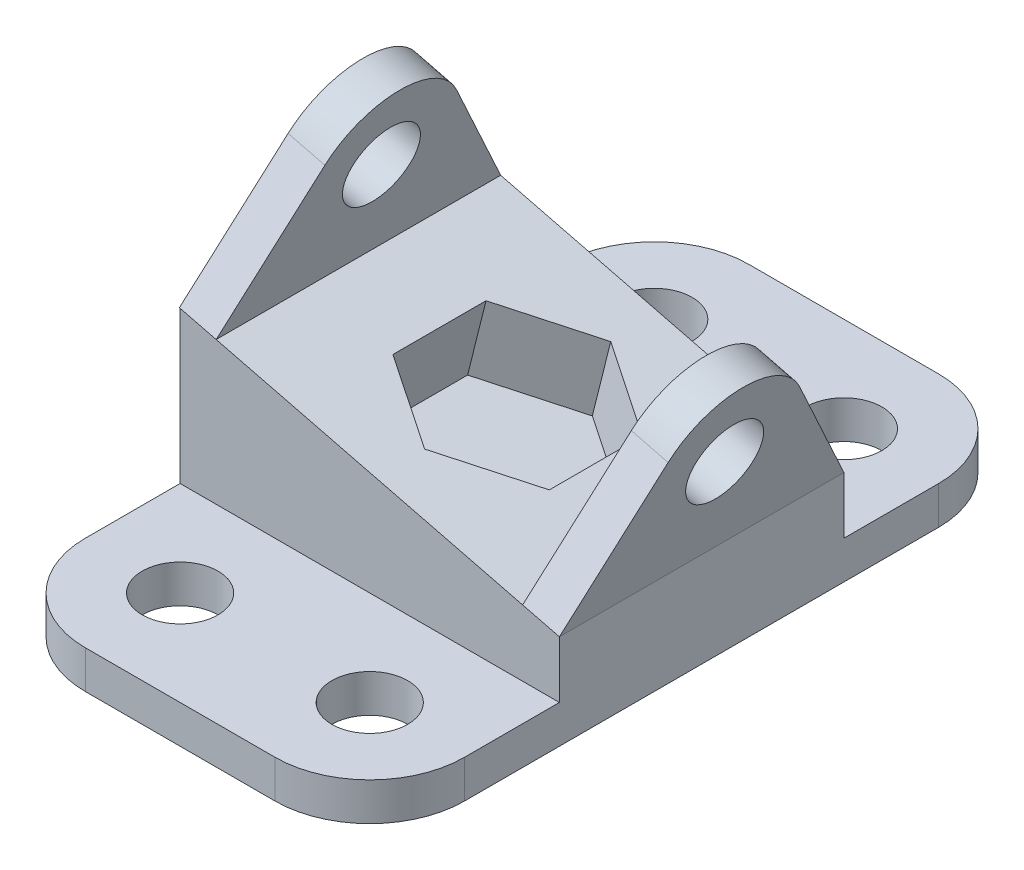
ISO-10303-21;
HEADER;
FILE_DESCRIPTION(('STEP AP214'),'2;1');
FILE_NAME('part.step','',(''),(''),'','','');
FILE_SCHEMA(('AUTOMOTIVE_DESIGN { 1 0 10303 214 1 1 1 1 }'));
ENDSEC;
DATA;
#1=APPLICATION_CONTEXT('core data for automotive mechanical design processes');
#2=APPLICATION_PROTOCOL_DEFINITION('international standard','automotive_design',2000,#1);
#3=PRODUCT_CONTEXT('',#1,'mechanical');
#4=PRODUCT('Part','Part','',(#3));
#5=PRODUCT_RELATED_PRODUCT_CATEGORY('part','',(#4));
#6=PRODUCT_DEFINITION_FORMATION('','',#4);
#7=PRODUCT_DEFINITION_CONTEXT('part definition',#1,'design');
#8=PRODUCT_DEFINITION('design','',#6,#7);
#9=PRODUCT_DEFINITION_SHAPE('','',#8);
#10=(LENGTH_UNIT() NAMED_UNIT(*) SI_UNIT(.MILLI.,.METRE.));
#11=(NAMED_UNIT(*) PLANE_ANGLE_UNIT() SI_UNIT($,.RADIAN.));
#12=(NAMED_UNIT(*) SI_UNIT($,.STERADIAN.) SOLID_ANGLE_UNIT());
#13=UNCERTAINTY_MEASURE_WITH_UNIT(LENGTH_MEASURE(1.E-05),#10,'distance_accuracy_value','');
#14=(GEOMETRIC_REPRESENTATION_CONTEXT(3) GLOBAL_UNCERTAINTY_ASSIGNED_CONTEXT((#13)) GLOBAL_UNIT_ASSIGNED_CONTEXT((#10,
#11,#12)) REPRESENTATION_CONTEXT('',''));
#15=CARTESIAN_POINT('',(0.,0.,0.));
#16=DIRECTION('',(0.,0.,1.));
#17=DIRECTION('',(1.,0.,0.));
#18=AXIS2_PLACEMENT_3D('',#15,#16,#17);
#19=CARTESIAN_POINT('',(0.,40.,60.));
#20=DIRECTION('',(1.,0.,0.));
#21=DIRECTION('',(0.,1.,0.));
#22=AXIS2_PLACEMENT_3D('',#19,#20,#21);
#23=PLANE('',#22);
#24=DIRECTION('',(0.,0.,-1.));
#25=VECTOR('',#24,1.);
#26=CARTESIAN_POINT('',(0.,0.,60.));
#27=LINE('',#26,#25);
#28=CARTESIAN_POINT('',(0.,0.,80.));
#29=VERTEX_POINT('',#28);
#30=CARTESIAN_POINT('',(0.,0.,-20.));
#31=VERTEX_POINT('',#30);
#32=EDGE_CURVE('E483',#29,#31,#27,.T.);
#33=ORIENTED_EDGE('',*,*,#32,.F.);
#34=DIRECTION('',(0.,-1.,0.));
#35=VECTOR('',#34,1.);
#36=CARTESIAN_POINT('',(0.,40.,80.));
#37=LINE('',#36,#35);
#38=CARTESIAN_POINT('',(0.,8.,80.));
#39=VERTEX_POINT('',#38);
#40=EDGE_CURVE('E511',#29,#39,#37,.F.);
#41=ORIENTED_EDGE('',*,*,#40,.T.);
#42=DIRECTION('',(0.,0.,-1.));
#43=VECTOR('',#42,1.);
#44=CARTESIAN_POINT('',(0.,8.,100.));
#45=LINE('',#44,#43);
#46=CARTESIAN_POINT('',(0.,8.,60.));
#47=VERTEX_POINT('',#46);
#48=EDGE_CURVE('E435',#39,#47,#45,.T.);
#49=ORIENTED_EDGE('',*,*,#48,.T.);
#50=DIRECTION('',(0.,-1.,0.));
#51=VECTOR('',#50,1.);
#52=CARTESIAN_POINT('',(0.,40.,60.));
#53=LINE('',#52,#51);
#54=CARTESIAN_POINT('',(0.,40.,60.));
#55=VERTEX_POINT('',#54);
#56=EDGE_CURVE('E445',#55,#47,#53,.T.);
#57=ORIENTED_EDGE('',*,*,#56,.F.);
#58=DIRECTION('',(0.,0.,-1.));
#59=VECTOR('',#58,1.);
#60=CARTESIAN_POINT('',(0.,40.,60.));
#61=LINE('',#60,#59);
#62=CARTESIAN_POINT('',(0.,40.,0.));
#63=VERTEX_POINT('',#62);
#64=EDGE_CURVE('E459',#55,#63,#61,.T.);
#65=ORIENTED_EDGE('',*,*,#64,.T.);
#66=DIRECTION('',(0.,-1.,0.));
#67=VECTOR('',#66,1.);
#68=CARTESIAN_POINT('',(0.,40.,0.));
#69=LINE('',#68,#67);
#70=CARTESIAN_POINT('',(0.,8.,0.));
#71=VERTEX_POINT('',#70);
#72=EDGE_CURVE('E444',#63,#71,#69,.T.);
#73=ORIENTED_EDGE('',*,*,#72,.T.);
#74=DIRECTION('',(0.,0.,1.));
#75=VECTOR('',#74,1.);
#76=CARTESIAN_POINT('',(0.,8.,-40.));
#77=LINE('',#76,#75);
#78=CARTESIAN_POINT('',(0.,8.,-20.));
#79=VERTEX_POINT('',#78);
#80=EDGE_CURVE('E423',#79,#71,#77,.T.);
#81=ORIENTED_EDGE('',*,*,#80,.F.);
#82=DIRECTION('',(0.,-1.,0.));
#83=VECTOR('',#82,1.);
#84=CARTESIAN_POINT('',(0.,40.,-20.));
#85=LINE('',#84,#83);
#86=EDGE_CURVE('E507',#79,#31,#85,.T.);
#87=ORIENTED_EDGE('',*,*,#86,.T.);
#88=EDGE_LOOP('',(#33,#41,#49,#57,#65,#73,#81,#87));
#89=FACE_BOUND('',#88,.T.);
#90=ADVANCED_FACE('F41',(#89),#23,.F.);
#91=CARTESIAN_POINT('',(0.,0.,60.));
#92=DIRECTION('',(0.,1.,0.));
#93=DIRECTION('',(0.,0.,1.));
#94=AXIS2_PLACEMENT_3D('',#91,#92,#93);
#95=PLANE('',#94);
#96=CARTESIAN_POINT('',(20.000000000001,0.,80.));
#97=DIRECTION('',(0.,1.,0.));
#98=DIRECTION('',(0.,0.,1.));
#99=AXIS2_PLACEMENT_3D('',#96,#97,#98);
#100=CIRCLE('',#99,8.);
#101=CARTESIAN_POINT('',(20.000000000001,0.,88.));
#102=VERTEX_POINT('',#101);
#103=EDGE_CURVE('E299',#102,#102,#100,.T.);
#104=ORIENTED_EDGE('',*,*,#103,.T.);
#105=EDGE_LOOP('',(#104));
#106=FACE_BOUND('',#105,.T.);
#107=CARTESIAN_POINT('',(60.000000000001,0.,80.));
#108=DIRECTION('',(0.,1.,0.));
#109=DIRECTION('',(0.,0.,1.));
#110=AXIS2_PLACEMENT_3D('',#107,#108,#109);
#111=CIRCLE('',#110,8.);
#112=CARTESIAN_POINT('',(60.000000000001,0.,88.));
#113=VERTEX_POINT('',#112);
#114=EDGE_CURVE('E291',#113,#113,#111,.T.);
#115=ORIENTED_EDGE('',*,*,#114,.T.);
#116=EDGE_LOOP('',(#115));
#117=FACE_BOUND('',#116,.T.);
#118=CARTESIAN_POINT('',(60.,0.,-20.));
#119=DIRECTION('',(0.,1.,0.));
#120=DIRECTION('',(0.,0.,1.));
#121=AXIS2_PLACEMENT_3D('',#118,#119,#120);
#122=CIRCLE('',#121,8.00000000000001);
#123=CARTESIAN_POINT('',(60.,0.,-12.));
#124=VERTEX_POINT('',#123);
#125=EDGE_CURVE('E282',#124,#124,#122,.T.);
#126=ORIENTED_EDGE('',*,*,#125,.T.);
#127=EDGE_LOOP('',(#126));
#128=FACE_BOUND('',#127,.T.);
#129=CARTESIAN_POINT('',(20.,0.,-20.));
#130=DIRECTION('',(0.,1.,0.));
#131=DIRECTION('',(0.,0.,1.));
#132=AXIS2_PLACEMENT_3D('',#129,#130,#131);
#133=CIRCLE('',#132,8.);
#134=CARTESIAN_POINT('',(20.,0.,-12.));
#135=VERTEX_POINT('',#134);
#136=EDGE_CURVE('E306',#135,#135,#133,.T.);
#137=ORIENTED_EDGE('',*,*,#136,.T.);
#138=EDGE_LOOP('',(#137));
#139=FACE_BOUND('',#138,.T.);
#140=DIRECTION('',(1.,0.,0.));
#141=VECTOR('',#140,1.);
#142=CARTESIAN_POINT('',(0.,0.,100.));
#143=LINE('',#142,#141);
#144=CARTESIAN_POINT('',(20.,0.,100.));
#145=VERTEX_POINT('',#144);
#146=CARTESIAN_POINT('',(60.,0.,100.));
#147=VERTEX_POINT('',#146);
#148=EDGE_CURVE('E427',#145,#147,#143,.T.);
#149=ORIENTED_EDGE('',*,*,#148,.F.);
#150=CARTESIAN_POINT('',(20.,0.,80.));
#151=DIRECTION('',(0.,1.,0.));
#152=DIRECTION('',(0.,0.,1.));
#153=AXIS2_PLACEMENT_3D('',#150,#151,#152);
#154=CIRCLE('',#153,20.);
#155=EDGE_CURVE('E504',#145,#29,#154,.F.);
#156=ORIENTED_EDGE('',*,*,#155,.T.);
#157=ORIENTED_EDGE('',*,*,#32,.T.);
#158=CARTESIAN_POINT('',(20.,0.,-20.));
#159=DIRECTION('',(0.,1.,0.));
#160=DIRECTION('',(0.,0.,1.));
#161=AXIS2_PLACEMENT_3D('',#158,#159,#160);
#162=CIRCLE('',#161,20.);
#163=CARTESIAN_POINT('',(20.,0.,-40.));
#164=VERTEX_POINT('',#163);
#165=EDGE_CURVE('E501',#31,#164,#162,.F.);
#166=ORIENTED_EDGE('',*,*,#165,.T.);
#167=DIRECTION('',(1.,0.,0.));
#168=VECTOR('',#167,1.);
#169=CARTESIAN_POINT('',(0.,0.,-40.));
#170=LINE('',#169,#168);
#171=CARTESIAN_POINT('',(60.,0.,-40.));
#172=VERTEX_POINT('',#171);
#173=EDGE_CURVE('E413',#164,#172,#170,.T.);
#174=ORIENTED_EDGE('',*,*,#173,.T.);
#175=CARTESIAN_POINT('',(60.,0.,-20.));
#176=DIRECTION('',(0.,1.,0.));
#177=DIRECTION('',(0.,0.,1.));
#178=AXIS2_PLACEMENT_3D('',#175,#176,#177);
#179=CIRCLE('',#178,20.);
#180=CARTESIAN_POINT('',(80.,0.,-20.));
#181=VERTEX_POINT('',#180);
#182=EDGE_CURVE('E498',#172,#181,#179,.F.);
#183=ORIENTED_EDGE('',*,*,#182,.T.);
#184=DIRECTION('',(0.,0.,-1.));
#185=VECTOR('',#184,1.);
#186=CARTESIAN_POINT('',(80.,0.,60.));
#187=LINE('',#186,#185);
#188=CARTESIAN_POINT('',(80.,0.,80.));
#189=VERTEX_POINT('',#188);
#190=EDGE_CURVE('E479',#189,#181,#187,.T.);
#191=ORIENTED_EDGE('',*,*,#190,.F.);
#192=CARTESIAN_POINT('',(60.,0.,80.));
#193=DIRECTION('',(0.,1.,0.));
#194=DIRECTION('',(0.,0.,1.));
#195=AXIS2_PLACEMENT_3D('',#192,#193,#194);
#196=CIRCLE('',#195,20.);
#197=EDGE_CURVE('E495',#189,#147,#196,.F.);
#198=ORIENTED_EDGE('',*,*,#197,.T.);
#199=EDGE_LOOP('',(#149,#156,#157,#166,#174,#183,#191,#198));
#200=FACE_BOUND('',#199,.T.);
#201=ADVANCED_FACE('F541',(#106,#117,#128,#139,#200),#95,.F.);
#202=CARTESIAN_POINT('',(80.,0.,60.));
#203=DIRECTION('',(-1.,0.,0.));
#204=DIRECTION('',(0.,0.,1.));
#205=AXIS2_PLACEMENT_3D('',#202,#203,#204);
#206=PLANE('',#205);
#207=ORIENTED_EDGE('',*,*,#190,.T.);
#208=DIRECTION('',(0.,1.,0.));
#209=VECTOR('',#208,1.);
#210=CARTESIAN_POINT('',(80.,0.,-20.));
#211=LINE('',#210,#209);
#212=CARTESIAN_POINT('',(80.,8.,-20.));
#213=VERTEX_POINT('',#212);
#214=EDGE_CURVE('E11',#181,#213,#211,.T.);
#215=ORIENTED_EDGE('',*,*,#214,.T.);
#216=DIRECTION('',(0.,0.,1.));
#217=VECTOR('',#216,1.);
#218=CARTESIAN_POINT('',(80.,8.,-40.));
#219=LINE('',#218,#217);
#220=CARTESIAN_POINT('',(80.,8.,0.));
#221=VERTEX_POINT('',#220);
#222=EDGE_CURVE('E417',#213,#221,#219,.T.);
#223=ORIENTED_EDGE('',*,*,#222,.T.);
#224=DIRECTION('',(0.,1.,0.));
#225=VECTOR('',#224,1.);
#226=CARTESIAN_POINT('',(80.,0.,0.));
#227=LINE('',#226,#225);
#228=CARTESIAN_POINT('',(80.,20.,0.));
#229=VERTEX_POINT('',#228);
#230=EDGE_CURVE('E463',#221,#229,#227,.T.);
#231=ORIENTED_EDGE('',*,*,#230,.T.);
#232=DIRECTION('',(0.,0.,-1.));
#233=VECTOR('',#232,1.);
#234=CARTESIAN_POINT('',(80.,20.,60.));
#235=LINE('',#234,#233);
#236=CARTESIAN_POINT('',(80.,20.,60.));
#237=VERTEX_POINT('',#236);
#238=EDGE_CURVE('E475',#237,#229,#235,.T.);
#239=ORIENTED_EDGE('',*,*,#238,.F.);
#240=DIRECTION('',(0.,1.,0.));
#241=VECTOR('',#240,1.);
#242=CARTESIAN_POINT('',(80.,0.,60.));
#243=LINE('',#242,#241);
#244=CARTESIAN_POINT('',(80.,8.,60.));
#245=VERTEX_POINT('',#244);
#246=EDGE_CURVE('E449',#245,#237,#243,.T.);
#247=ORIENTED_EDGE('',*,*,#246,.F.);
#248=DIRECTION('',(0.,0.,-1.));
#249=VECTOR('',#248,1.);
#250=CARTESIAN_POINT('',(80.,8.,100.));
#251=LINE('',#250,#249);
#252=CARTESIAN_POINT('',(80.,8.,80.));
#253=VERTEX_POINT('',#252);
#254=EDGE_CURVE('E441',#253,#245,#251,.T.);
#255=ORIENTED_EDGE('',*,*,#254,.F.);
#256=DIRECTION('',(0.,1.,0.));
#257=VECTOR('',#256,1.);
#258=CARTESIAN_POINT('',(80.,0.,80.));
#259=LINE('',#258,#257);
#260=EDGE_CURVE('E50',#253,#189,#259,.F.);
#261=ORIENTED_EDGE('',*,*,#260,.T.);
#262=EDGE_LOOP('',(#207,#215,#223,#231,#239,#247,#255,#261));
#263=FACE_BOUND('',#262,.T.);
#264=ADVANCED_FACE('F535',(#263),#206,.F.);
#265=CARTESIAN_POINT('',(80.,20.,60.));
#266=DIRECTION('',(-0.242535625036333,-0.970142500145332,0.));
#267=DIRECTION('',(0.970142500145332,-0.242535625036333,0.));
#268=AXIS2_PLACEMENT_3D('',#265,#266,#267);
#269=PLANE('',#268);
#270=DIRECTION('',(-0.840168050416806,0.210042012604201,0.5));
#271=VECTOR('',#270,1.);
#272=CARTESIAN_POINT('',(41.1942999941868,29.7014250014533,10.3700908475527));
#273=LINE('',#272,#271);
#274=CARTESIAN_POINT('',(41.1942999941868,29.7014250014533,10.3700908475527));
#275=VERTEX_POINT('',#274);
#276=CARTESIAN_POINT('',(24.7018774917161,33.824530627071,20.1850454237764));
#277=VERTEX_POINT('',#276);
#278=EDGE_CURVE('E253',#275,#277,#273,.T.);
#279=ORIENTED_EDGE('',*,*,#278,.F.);
#280=DIRECTION('',(-0.840168050416806,0.210042012604201,-0.5));
#281=VECTOR('',#280,1.);
#282=CARTESIAN_POINT('',(57.6867224966574,25.5783193758357,20.1850454237764));
#283=LINE('',#282,#281);
#284=CARTESIAN_POINT('',(57.6867224966574,25.5783193758357,20.1850454237764));
#285=VERTEX_POINT('',#284);
#286=EDGE_CURVE('E57',#285,#275,#283,.T.);
#287=ORIENTED_EDGE('',*,*,#286,.F.);
#288=DIRECTION('',(0.,0.,-1.));
#289=VECTOR('',#288,1.);
#290=CARTESIAN_POINT('',(57.6867224966574,25.5783193758357,39.8149545762237));
#291=LINE('',#290,#289);
#292=CARTESIAN_POINT('',(57.6867224966574,25.5783193758357,39.8149545762237));
#293=VERTEX_POINT('',#292);
#294=EDGE_CURVE('E233',#293,#285,#291,.T.);
#295=ORIENTED_EDGE('',*,*,#294,.F.);
#296=DIRECTION('',(0.840168050416806,-0.210042012604201,-0.5));
#297=VECTOR('',#296,1.);
#298=CARTESIAN_POINT('',(41.1942999941868,29.7014250014533,49.6299091524473));
#299=LINE('',#298,#297);
#300=CARTESIAN_POINT('',(41.1942999941868,29.7014250014533,49.6299091524473));
#301=VERTEX_POINT('',#300);
#302=EDGE_CURVE('E237',#301,#293,#299,.T.);
#303=ORIENTED_EDGE('',*,*,#302,.F.);
#304=DIRECTION('',(0.840168050416806,-0.210042012604202,0.5));
#305=VECTOR('',#304,1.);
#306=CARTESIAN_POINT('',(24.7018774917161,33.824530627071,39.8149545762236));
#307=LINE('',#306,#305);
#308=CARTESIAN_POINT('',(24.7018774917161,33.824530627071,39.8149545762236));
#309=VERTEX_POINT('',#308);
#310=EDGE_CURVE('E260',#309,#301,#307,.T.);
#311=ORIENTED_EDGE('',*,*,#310,.F.);
#312=DIRECTION('',(0.,0.,1.));
#313=VECTOR('',#312,1.);
#314=CARTESIAN_POINT('',(24.7018774917161,33.824530627071,20.1850454237764));
#315=LINE('',#314,#313);
#316=EDGE_CURVE('E256',#277,#309,#315,.T.);
#317=ORIENTED_EDGE('',*,*,#316,.F.);
#318=EDGE_LOOP('',(#279,#287,#295,#303,#311,#317));
#319=FACE_BOUND('',#318,.T.);
#320=DIRECTION('',(-0.970142500145332,0.242535625036333,0.));
#321=VECTOR('',#320,1.);
#322=CARTESIAN_POINT('',(80.,20.,0.));
#323=LINE('',#322,#321);
#324=CARTESIAN_POINT('',(72.2388599988374,21.9402850002907,0.));
#325=VERTEX_POINT('',#324);
#326=CARTESIAN_POINT('',(7.60796663915537,38.0980083402112,0.));
#327=VERTEX_POINT('',#326);
#328=EDGE_CURVE('E471',#325,#327,#323,.T.);
#329=ORIENTED_EDGE('',*,*,#328,.T.);
#330=DIRECTION('',(0.,0.,-1.));
#331=VECTOR('',#330,1.);
#332=CARTESIAN_POINT('',(7.60796663915536,38.0980083402111,0.));
#333=LINE('',#332,#331);
#334=CARTESIAN_POINT('',(7.60796663915537,38.0980083402112,60.));
#335=VERTEX_POINT('',#334);
#336=EDGE_CURVE('E346',#335,#327,#333,.T.);
#337=ORIENTED_EDGE('',*,*,#336,.F.);
#338=DIRECTION('',(-0.970142500145332,0.242535625036333,0.));
#339=VECTOR('',#338,1.);
#340=CARTESIAN_POINT('',(80.,20.,60.));
#341=LINE('',#340,#339);
#342=CARTESIAN_POINT('',(72.2388599988374,21.9402850002907,60.));
#343=VERTEX_POINT('',#342);
#344=EDGE_CURVE('E454',#343,#335,#341,.T.);
#345=ORIENTED_EDGE('',*,*,#344,.F.);
#346=DIRECTION('',(0.,0.,-1.));
#347=VECTOR('',#346,1.);
#348=CARTESIAN_POINT('',(72.2388599988374,21.9402850002907,0.));
#349=LINE('',#348,#347);
#350=EDGE_CURVE('E380',#343,#325,#349,.T.);
#351=ORIENTED_EDGE('',*,*,#350,.T.);
#352=EDGE_LOOP('',(#329,#337,#345,#351));
#353=FACE_BOUND('',#352,.T.);
#354=ADVANCED_FACE('F614',(#319,#353),#269,.F.);
#355=CARTESIAN_POINT('',(0.,0.,60.));
#356=DIRECTION('',(0.,0.,1.));
#357=DIRECTION('',(1.,0.,0.));
#358=AXIS2_PLACEMENT_3D('',#355,#356,#357);
#359=PLANE('',#358);
#360=DIRECTION('',(-1.,0.,0.));
#361=VECTOR('',#360,1.);
#362=CARTESIAN_POINT('',(0.,8.,60.));
#363=LINE('',#362,#361);
#364=EDGE_CURVE('E426',#245,#47,#363,.T.);
#365=ORIENTED_EDGE('',*,*,#364,.F.);
#366=ORIENTED_EDGE('',*,*,#246,.T.);
#367=EDGE_CURVE('E455',#237,#343,#341,.T.);
#368=ORIENTED_EDGE('',*,*,#367,.T.);
#369=ORIENTED_EDGE('',*,*,#344,.T.);
#370=DIRECTION('',(0.970142500145332,-0.242535625036333,0.));
#371=VECTOR('',#370,1.);
#372=CARTESIAN_POINT('',(-0.153173362007295,40.0382933405018,60.));
#373=LINE('',#372,#371);
#374=EDGE_CURVE('E362',#55,#335,#373,.T.);
#375=ORIENTED_EDGE('',*,*,#374,.F.);
#376=ORIENTED_EDGE('',*,*,#56,.T.);
#377=EDGE_LOOP('',(#365,#366,#368,#369,#375,#376));
#378=FACE_BOUND('',#377,.T.);
#379=ADVANCED_FACE('F587',(#378),#359,.T.);
#380=CARTESIAN_POINT('',(0.,0.,0.));
#381=DIRECTION('',(0.,0.,1.));
#382=DIRECTION('',(1.,0.,0.));
#383=AXIS2_PLACEMENT_3D('',#380,#381,#382);
#384=PLANE('',#383);
#385=ORIENTED_EDGE('',*,*,#230,.F.);
#386=DIRECTION('',(-1.,0.,0.));
#387=VECTOR('',#386,1.);
#388=CARTESIAN_POINT('',(0.,8.,0.));
#389=LINE('',#388,#387);
#390=EDGE_CURVE('E406',#221,#71,#389,.T.);
#391=ORIENTED_EDGE('',*,*,#390,.T.);
#392=ORIENTED_EDGE('',*,*,#72,.F.);
#393=EDGE_CURVE('E467',#327,#63,#323,.T.);
#394=ORIENTED_EDGE('',*,*,#393,.F.);
#395=ORIENTED_EDGE('',*,*,#328,.F.);
#396=EDGE_CURVE('E450',#229,#325,#323,.T.);
#397=ORIENTED_EDGE('',*,*,#396,.F.);
#398=EDGE_LOOP('',(#385,#391,#392,#394,#395,#397));
#399=FACE_BOUND('',#398,.T.);
#400=ADVANCED_FACE('F575',(#399),#384,.F.);
#401=CARTESIAN_POINT('',(0.,8.,100.));
#402=DIRECTION('',(0.,-1.,0.));
#403=DIRECTION('',(0.,0.,-1.));
#404=AXIS2_PLACEMENT_3D('',#401,#402,#403);
#405=PLANE('',#404);
#406=CARTESIAN_POINT('',(20.000000000001,8.,80.));
#407=DIRECTION('',(0.,1.,0.));
#408=DIRECTION('',(0.,0.,1.));
#409=AXIS2_PLACEMENT_3D('',#406,#407,#408);
#410=CIRCLE('',#409,8.);
#411=CARTESIAN_POINT('',(20.000000000001,8.,88.));
#412=VERTEX_POINT('',#411);
#413=EDGE_CURVE('E270',#412,#412,#410,.T.);
#414=ORIENTED_EDGE('',*,*,#413,.F.);
#415=EDGE_LOOP('',(#414));
#416=FACE_BOUND('',#415,.T.);
#417=CARTESIAN_POINT('',(60.000000000001,8.,80.));
#418=DIRECTION('',(0.,1.,0.));
#419=DIRECTION('',(0.,0.,1.));
#420=AXIS2_PLACEMENT_3D('',#417,#418,#419);
#421=CIRCLE('',#420,8.);
#422=CARTESIAN_POINT('',(60.000000000001,8.,88.));
#423=VERTEX_POINT('',#422);
#424=EDGE_CURVE('E295',#423,#423,#421,.T.);
#425=ORIENTED_EDGE('',*,*,#424,.F.);
#426=EDGE_LOOP('',(#425));
#427=FACE_BOUND('',#426,.T.);
#428=ORIENTED_EDGE('',*,*,#48,.F.);
#429=CARTESIAN_POINT('',(20.,8.,80.));
#430=DIRECTION('',(0.,-1.,0.));
#431=DIRECTION('',(0.,0.,-1.));
#432=AXIS2_PLACEMENT_3D('',#429,#430,#431);
#433=CIRCLE('',#432,20.);
#434=CARTESIAN_POINT('',(20.,8.,100.));
#435=VERTEX_POINT('',#434);
#436=EDGE_CURVE('E517',#39,#435,#433,.F.);
#437=ORIENTED_EDGE('',*,*,#436,.T.);
#438=DIRECTION('',(-1.,0.,0.));
#439=VECTOR('',#438,1.);
#440=CARTESIAN_POINT('',(0.,8.,100.));
#441=LINE('',#440,#439);
#442=CARTESIAN_POINT('',(60.,8.,100.));
#443=VERTEX_POINT('',#442);
#444=EDGE_CURVE('E431',#443,#435,#441,.T.);
#445=ORIENTED_EDGE('',*,*,#444,.F.);
#446=CARTESIAN_POINT('',(60.,8.,80.));
#447=DIRECTION('',(0.,-1.,0.));
#448=DIRECTION('',(0.,0.,-1.));
#449=AXIS2_PLACEMENT_3D('',#446,#447,#448);
#450=CIRCLE('',#449,20.);
#451=EDGE_CURVE('E514',#443,#253,#450,.F.);
#452=ORIENTED_EDGE('',*,*,#451,.T.);
#453=ORIENTED_EDGE('',*,*,#254,.T.);
#454=ORIENTED_EDGE('',*,*,#364,.T.);
#455=EDGE_LOOP('',(#428,#437,#445,#452,#453,#454));
#456=FACE_BOUND('',#455,.T.);
#457=ADVANCED_FACE('F550',(#416,#427,#456),#405,.F.);
#458=CARTESIAN_POINT('',(0.,0.,100.));
#459=DIRECTION('',(0.,0.,-1.));
#460=DIRECTION('',(-1.,0.,0.));
#461=AXIS2_PLACEMENT_3D('',#458,#459,#460);
#462=PLANE('',#461);
#463=ORIENTED_EDGE('',*,*,#444,.T.);
#464=DIRECTION('',(0.,-1.,0.));
#465=VECTOR('',#464,1.);
#466=CARTESIAN_POINT('',(20.,0.,100.));
#467=LINE('',#466,#465);
#468=EDGE_CURVE('E491',#435,#145,#467,.T.);
#469=ORIENTED_EDGE('',*,*,#468,.T.);
#470=ORIENTED_EDGE('',*,*,#148,.T.);
#471=DIRECTION('',(0.,1.,0.));
#472=VECTOR('',#471,1.);
#473=CARTESIAN_POINT('',(60.,0.,100.));
#474=LINE('',#473,#472);
#475=EDGE_CURVE('E487',#147,#443,#474,.T.);
#476=ORIENTED_EDGE('',*,*,#475,.T.);
#477=EDGE_LOOP('',(#463,#469,#470,#476));
#478=FACE_BOUND('',#477,.T.);
#479=ADVANCED_FACE('F546',(#478),#462,.F.);
#480=CARTESIAN_POINT('',(0.,8.,-40.));
#481=DIRECTION('',(0.,1.,0.));
#482=DIRECTION('',(0.,0.,1.));
#483=AXIS2_PLACEMENT_3D('',#480,#481,#482);
#484=PLANE('',#483);
#485=CARTESIAN_POINT('',(60.,8.,-20.));
#486=DIRECTION('',(0.,1.,0.));
#487=DIRECTION('',(0.,0.,1.));
#488=AXIS2_PLACEMENT_3D('',#485,#486,#487);
#489=CIRCLE('',#488,8.00000000000001);
#490=CARTESIAN_POINT('',(60.,8.,-12.));
#491=VERTEX_POINT('',#490);
#492=EDGE_CURVE('E287',#491,#491,#489,.T.);
#493=ORIENTED_EDGE('',*,*,#492,.F.);
#494=EDGE_LOOP('',(#493));
#495=FACE_BOUND('',#494,.T.);
#496=CARTESIAN_POINT('',(20.,8.,-20.));
#497=DIRECTION('',(0.,1.,0.));
#498=DIRECTION('',(0.,0.,1.));
#499=AXIS2_PLACEMENT_3D('',#496,#497,#498);
#500=CIRCLE('',#499,8.);
#501=CARTESIAN_POINT('',(20.,8.,-12.));
#502=VERTEX_POINT('',#501);
#503=EDGE_CURVE('E286',#502,#502,#500,.T.);
#504=ORIENTED_EDGE('',*,*,#503,.F.);
#505=EDGE_LOOP('',(#504));
#506=FACE_BOUND('',#505,.T.);
#507=DIRECTION('',(-1.,0.,0.));
#508=VECTOR('',#507,1.);
#509=CARTESIAN_POINT('',(0.,8.,-40.));
#510=LINE('',#509,#508);
#511=CARTESIAN_POINT('',(60.,8.,-40.));
#512=VERTEX_POINT('',#511);
#513=CARTESIAN_POINT('',(20.,8.,-40.));
#514=VERTEX_POINT('',#513);
#515=EDGE_CURVE('E409',#512,#514,#510,.T.);
#516=ORIENTED_EDGE('',*,*,#515,.T.);
#517=CARTESIAN_POINT('',(20.,8.,-20.));
#518=DIRECTION('',(0.,1.,0.));
#519=DIRECTION('',(0.,0.,1.));
#520=AXIS2_PLACEMENT_3D('',#517,#518,#519);
#521=CIRCLE('',#520,20.);
#522=EDGE_CURVE('E528',#514,#79,#521,.T.);
#523=ORIENTED_EDGE('',*,*,#522,.T.);
#524=ORIENTED_EDGE('',*,*,#80,.T.);
#525=ORIENTED_EDGE('',*,*,#390,.F.);
#526=ORIENTED_EDGE('',*,*,#222,.F.);
#527=CARTESIAN_POINT('',(60.,8.,-20.));
#528=DIRECTION('',(0.,1.,0.));
#529=DIRECTION('',(0.,0.,1.));
#530=AXIS2_PLACEMENT_3D('',#527,#528,#529);
#531=CIRCLE('',#530,20.);
#532=EDGE_CURVE('E65',#213,#512,#531,.T.);
#533=ORIENTED_EDGE('',*,*,#532,.T.);
#534=EDGE_LOOP('',(#516,#523,#524,#525,#526,#533));
#535=FACE_BOUND('',#534,.T.);
#536=ADVANCED_FACE('F571',(#495,#506,#535),#484,.T.);
#537=CARTESIAN_POINT('',(0.,0.,-40.));
#538=DIRECTION('',(0.,0.,1.));
#539=DIRECTION('',(-1.,0.,0.));
#540=AXIS2_PLACEMENT_3D('',#537,#538,#539);
#541=PLANE('',#540);
#542=ORIENTED_EDGE('',*,*,#173,.F.);
#543=DIRECTION('',(0.,-1.,0.));
#544=VECTOR('',#543,1.);
#545=CARTESIAN_POINT('',(20.,0.,-40.));
#546=LINE('',#545,#544);
#547=EDGE_CURVE('E523',#164,#514,#546,.F.);
#548=ORIENTED_EDGE('',*,*,#547,.T.);
#549=ORIENTED_EDGE('',*,*,#515,.F.);
#550=DIRECTION('',(0.,1.,0.));
#551=VECTOR('',#550,1.);
#552=CARTESIAN_POINT('',(60.,0.,-40.));
#553=LINE('',#552,#551);
#554=EDGE_CURVE('E520',#512,#172,#553,.F.);
#555=ORIENTED_EDGE('',*,*,#554,.T.);
#556=EDGE_LOOP('',(#542,#548,#549,#555));
#557=FACE_BOUND('',#556,.T.);
#558=ADVANCED_FACE('F565',(#557),#541,.F.);
#559=CARTESIAN_POINT('',(65.1751858698745,-6.31441151556082,-16.7917983918046));
#560=DIRECTION('',(0.121142750941799,0.484571003767196,-0.866322905273955));
#561=DIRECTION('',(0.,0.87275062984205,0.488166301694724));
#562=AXIS2_PLACEMENT_3D('',#559,#560,#561);
#563=PLANE('',#562);
#564=DIRECTION('',(0.21011416731391,0.840456669255642,0.499484357910931));
#565=VECTOR('',#564,1.);
#566=CARTESIAN_POINT('',(72.9363258710372,-8.25469651585149,-16.7917983918046));
#567=LINE('',#566,#565);
#568=CARTESIAN_POINT('',(86.7889965157955,47.1559860631818,16.1388335156167));
#569=VERTEX_POINT('',#568);
#570=EDGE_CURVE('E357',#229,#569,#567,.T.);
#571=ORIENTED_EDGE('',*,*,#570,.F.);
#572=ORIENTED_EDGE('',*,*,#396,.T.);
#573=DIRECTION('',(0.21011416731391,0.840456669255642,0.499484357910931));
#574=VECTOR('',#573,1.);
#575=CARTESIAN_POINT('',(65.1751858698745,-6.31441151556082,-16.7917983918046));
#576=LINE('',#575,#574);
#577=CARTESIAN_POINT('',(79.0278565146328,49.0962710634725,16.1388335156167));
#578=VERTEX_POINT('',#577);
#579=EDGE_CURVE('E368',#325,#578,#576,.T.);
#580=ORIENTED_EDGE('',*,*,#579,.T.);
#581=DIRECTION('',(0.970142500145332,-0.242535625036333,0.));
#582=VECTOR('',#581,1.);
#583=CARTESIAN_POINT('',(79.0278565146328,49.0962710634725,16.1388335156167));
#584=LINE('',#583,#582);
#585=EDGE_CURVE('E388',#578,#569,#584,.T.);
#586=ORIENTED_EDGE('',*,*,#585,.T.);
#587=EDGE_LOOP('',(#571,#572,#580,#586));
#588=FACE_BOUND('',#587,.T.);
#589=ADVANCED_FACE('F622',(#588),#563,.T.);
#590=CARTESIAN_POINT('',(71.4721102668012,18.873286072146,61.8227209639429));
#591=DIRECTION('',(-0.121142750941799,-0.484571003767196,-0.866322905273954));
#592=DIRECTION('',(0.,0.87275062984205,-0.488166301694724));
#593=AXIS2_PLACEMENT_3D('',#590,#591,#592);
#594=PLANE('',#593);
#595=DIRECTION('',(0.21011416731391,0.840456669255642,-0.499484357910931));
#596=VECTOR('',#595,1.);
#597=CARTESIAN_POINT('',(79.2332502679639,16.9330010718553,61.8227209639429));
#598=LINE('',#597,#596);
#599=CARTESIAN_POINT('',(86.7889965157955,47.1559860631818,43.8611664843832));
#600=VERTEX_POINT('',#599);
#601=EDGE_CURVE('E396',#237,#600,#598,.T.);
#602=ORIENTED_EDGE('',*,*,#601,.T.);
#603=DIRECTION('',(0.970142500145332,-0.242535625036333,0.));
#604=VECTOR('',#603,1.);
#605=CARTESIAN_POINT('',(79.0278565146328,49.0962710634725,43.8611664843832));
#606=LINE('',#605,#604);
#607=CARTESIAN_POINT('',(79.0278565146328,49.0962710634725,43.8611664843832));
#608=VERTEX_POINT('',#607);
#609=EDGE_CURVE('E403',#608,#600,#606,.T.);
#610=ORIENTED_EDGE('',*,*,#609,.F.);
#611=DIRECTION('',(0.21011416731391,0.840456669255642,-0.499484357910931));
#612=VECTOR('',#611,1.);
#613=CARTESIAN_POINT('',(71.4721102668012,18.873286072146,61.8227209639429));
#614=LINE('',#613,#612);
#615=EDGE_CURVE('E377',#343,#608,#614,.T.);
#616=ORIENTED_EDGE('',*,*,#615,.F.);
#617=ORIENTED_EDGE('',*,*,#367,.F.);
#618=EDGE_LOOP('',(#602,#610,#616,#617));
#619=FACE_BOUND('',#618,.T.);
#620=ADVANCED_FACE('F625',(#619),#594,.F.);
#621=CARTESIAN_POINT('',(77.0895724995641,41.3431350031973,30.));
#622=DIRECTION('',(0.970142500145332,-0.242535625036333,0.));
#623=DIRECTION('',(0.242535625036333,0.970142500145332,0.));
#624=AXIS2_PLACEMENT_3D('',#621,#622,#623);
#625=CYLINDRICAL_SURFACE('',#624,16.);
#626=CARTESIAN_POINT('',(84.8507125007267,39.4028500029066,30.));
#627=DIRECTION('',(0.970142500145332,-0.242535625036333,0.));
#628=DIRECTION('',(0.242535625036333,0.970142500145332,0.));
#629=AXIS2_PLACEMENT_3D('',#626,#627,#628);
#630=CIRCLE('',#629,16.);
#631=EDGE_CURVE('E392',#569,#600,#630,.T.);
#632=ORIENTED_EDGE('',*,*,#631,.F.);
#633=ORIENTED_EDGE('',*,*,#585,.F.);
#634=CARTESIAN_POINT('',(77.0895724995641,41.3431350031973,30.));
#635=DIRECTION('',(0.970142500145332,-0.242535625036333,0.));
#636=DIRECTION('',(0.242535625036333,0.970142500145332,0.));
#637=AXIS2_PLACEMENT_3D('',#634,#635,#636);
#638=CIRCLE('',#637,16.);
#639=EDGE_CURVE('E372',#578,#608,#638,.T.);
#640=ORIENTED_EDGE('',*,*,#639,.T.);
#641=ORIENTED_EDGE('',*,*,#609,.T.);
#642=EDGE_LOOP('',(#632,#633,#640,#641));
#643=FACE_BOUND('',#642,.T.);
#644=ADVANCED_FACE('F624',(#643),#625,.T.);
#645=CARTESIAN_POINT('',(77.0895724995641,41.3431350031973,30.));
#646=DIRECTION('',(0.970142500145332,-0.242535625036333,0.));
#647=DIRECTION('',(0.242535625036333,0.970142500145332,0.));
#648=AXIS2_PLACEMENT_3D('',#645,#646,#647);
#649=CYLINDRICAL_SURFACE('',#648,8.);
#650=CARTESIAN_POINT('',(77.0895724995641,41.3431350031973,30.));
#651=DIRECTION('',(0.970142500145332,-0.242535625036333,0.));
#652=DIRECTION('',(0.242535625036333,0.970142500145332,0.));
#653=AXIS2_PLACEMENT_3D('',#650,#651,#652);
#654=CIRCLE('',#653,8.);
#655=CARTESIAN_POINT('',(79.0298574998547,49.10427500436,30.));
#656=VERTEX_POINT('',#655);
#657=EDGE_CURVE('E384',#656,#656,#654,.T.);
#658=ORIENTED_EDGE('',*,*,#657,.F.);
#659=EDGE_LOOP('',(#658));
#660=FACE_BOUND('',#659,.T.);
#661=CARTESIAN_POINT('',(84.8507125007267,39.4028500029066,30.));
#662=DIRECTION('',(0.970142500145332,-0.242535625036333,0.));
#663=DIRECTION('',(0.242535625036333,0.970142500145332,0.));
#664=AXIS2_PLACEMENT_3D('',#661,#662,#663);
#665=CIRCLE('',#664,8.);
#666=CARTESIAN_POINT('',(86.7909975010174,47.1639900040693,30.));
#667=VERTEX_POINT('',#666);
#668=EDGE_CURVE('E373',#667,#667,#665,.T.);
#669=ORIENTED_EDGE('',*,*,#668,.T.);
#670=EDGE_LOOP('',(#669));
#671=FACE_BOUND('',#670,.T.);
#672=ADVANCED_FACE('F632',(#660,#671),#649,.F.);
#673=CARTESIAN_POINT('',(62.827095292955,-15.7067738232388,0.));
#674=DIRECTION('',(0.970142500145332,-0.242535625036333,0.));
#675=DIRECTION('',(0.242535625036333,0.970142500145332,0.));
#676=AXIS2_PLACEMENT_3D('',#673,#674,#675);
#677=PLANE('',#676);
#678=ORIENTED_EDGE('',*,*,#579,.F.);
#679=ORIENTED_EDGE('',*,*,#350,.F.);
#680=ORIENTED_EDGE('',*,*,#615,.T.);
#681=ORIENTED_EDGE('',*,*,#639,.F.);
#682=EDGE_LOOP('',(#678,#679,#680,#681));
#683=FACE_BOUND('',#682,.T.);
#684=ORIENTED_EDGE('',*,*,#657,.T.);
#685=EDGE_LOOP('',(#684));
#686=FACE_BOUND('',#685,.T.);
#687=ADVANCED_FACE('F618',(#683,#686),#677,.F.);
#688=CARTESIAN_POINT('',(70.5882352941177,-17.6470588235294,0.));
#689=DIRECTION('',(0.970142500145332,-0.242535625036333,0.));
#690=DIRECTION('',(0.242535625036333,0.970142500145332,0.));
#691=AXIS2_PLACEMENT_3D('',#688,#689,#690);
#692=PLANE('',#691);
#693=ORIENTED_EDGE('',*,*,#570,.T.);
#694=ORIENTED_EDGE('',*,*,#631,.T.);
#695=ORIENTED_EDGE('',*,*,#601,.F.);
#696=ORIENTED_EDGE('',*,*,#238,.T.);
#697=EDGE_LOOP('',(#693,#694,#695,#696));
#698=FACE_BOUND('',#697,.T.);
#699=ORIENTED_EDGE('',*,*,#668,.F.);
#700=EDGE_LOOP('',(#699));
#701=FACE_BOUND('',#700,.T.);
#702=ADVANCED_FACE('F580',(#698,#701),#692,.T.);
#703=CARTESIAN_POINT('',(-0.153173362007295,40.0382933405018,0.));
#704=DIRECTION('',(-0.242535625036333,-0.970142500145332,0.));
#705=DIRECTION('',(0.970142500145332,-0.242535625036333,0.));
#706=AXIS2_PLACEMENT_3D('',#703,#704,#705);
#707=PLANE('',#706);
#708=ORIENTED_EDGE('',*,*,#64,.F.);
#709=CARTESIAN_POINT('',(-0.153173362007295,40.0382933405018,60.));
#710=VERTEX_POINT('',#709);
#711=EDGE_CURVE('E358',#710,#55,#373,.T.);
#712=ORIENTED_EDGE('',*,*,#711,.F.);
#713=DIRECTION('',(0.,0.,-1.));
#714=VECTOR('',#713,1.);
#715=CARTESIAN_POINT('',(-0.153173362007295,40.0382933405018,0.));
#716=LINE('',#715,#714);
#717=CARTESIAN_POINT('',(-0.153173362007295,40.0382933405018,0.));
#718=VERTEX_POINT('',#717);
#719=EDGE_CURVE('E326',#710,#718,#716,.T.);
#720=ORIENTED_EDGE('',*,*,#719,.T.);
#721=DIRECTION('',(0.970142500145332,-0.242535625036333,0.));
#722=VECTOR('',#721,1.);
#723=CARTESIAN_POINT('',(-0.153173362007295,40.0382933405018,0.));
#724=LINE('',#723,#722);
#725=EDGE_CURVE('E353',#718,#63,#724,.T.);
#726=ORIENTED_EDGE('',*,*,#725,.T.);
#727=EDGE_LOOP('',(#708,#712,#720,#726));
#728=FACE_BOUND('',#727,.T.);
#729=ADVANCED_FACE('F594',(#728),#707,.T.);
#730=CARTESIAN_POINT('',(-7.21684749097017,11.7835968246503,-16.7917983918045));
#731=DIRECTION('',(0.121142750941799,0.484571003767196,-0.866322905273955));
#732=DIRECTION('',(0.,0.87275062984205,0.488166301694724));
#733=AXIS2_PLACEMENT_3D('',#730,#731,#732);
#734=PLANE('',#733);
#735=DIRECTION('',(0.21011416731391,0.840456669255642,0.499484357910931));
#736=VECTOR('',#735,1.);
#737=CARTESIAN_POINT('',(0.544292510192487,9.84331182435966,-16.7917983918045));
#738=LINE('',#737,#736);
#739=CARTESIAN_POINT('',(14.3969631549508,65.2539944033929,16.1388335156167));
#740=VERTEX_POINT('',#739);
#741=EDGE_CURVE('E310',#327,#740,#738,.T.);
#742=ORIENTED_EDGE('',*,*,#741,.F.);
#743=ORIENTED_EDGE('',*,*,#393,.T.);
#744=ORIENTED_EDGE('',*,*,#725,.F.);
#745=DIRECTION('',(0.21011416731391,0.840456669255642,0.499484357910931));
#746=VECTOR('',#745,1.);
#747=CARTESIAN_POINT('',(-7.21684749097017,11.7835968246503,-16.7917983918045));
#748=LINE('',#747,#746);
#749=CARTESIAN_POINT('',(6.63582315378816,67.1942794036836,16.1388335156167));
#750=VERTEX_POINT('',#749);
#751=EDGE_CURVE('E314',#718,#750,#748,.T.);
#752=ORIENTED_EDGE('',*,*,#751,.T.);
#753=DIRECTION('',(0.970142500145332,-0.242535625036333,0.));
#754=VECTOR('',#753,1.);
#755=CARTESIAN_POINT('',(6.63582315378816,67.1942794036836,16.1388335156167));
#756=LINE('',#755,#754);
#757=EDGE_CURVE('E334',#750,#740,#756,.T.);
#758=ORIENTED_EDGE('',*,*,#757,.T.);
#759=EDGE_LOOP('',(#742,#743,#744,#752,#758));
#760=FACE_BOUND('',#759,.T.);
#761=ADVANCED_FACE('F608',(#760),#734,.T.);
#762=CARTESIAN_POINT('',(-0.91992309404346,36.9712944123572,61.8227209639429));
#763=DIRECTION('',(-0.121142750941799,-0.484571003767196,-0.866322905273954));
#764=DIRECTION('',(0.,0.87275062984205,-0.488166301694724));
#765=AXIS2_PLACEMENT_3D('',#762,#763,#764);
#766=PLANE('',#765);
#767=DIRECTION('',(0.21011416731391,0.840456669255642,-0.499484357910931));
#768=VECTOR('',#767,1.);
#769=CARTESIAN_POINT('',(6.8412169071192,35.0310094120665,61.8227209639429));
#770=LINE('',#769,#768);
#771=CARTESIAN_POINT('',(14.3969631549508,65.253994403393,43.8611664843833));
#772=VERTEX_POINT('',#771);
#773=EDGE_CURVE('E342',#335,#772,#770,.T.);
#774=ORIENTED_EDGE('',*,*,#773,.T.);
#775=DIRECTION('',(0.970142500145332,-0.242535625036333,0.));
#776=VECTOR('',#775,1.);
#777=CARTESIAN_POINT('',(6.63582315378816,67.1942794036836,43.8611664843833));
#778=LINE('',#777,#776);
#779=CARTESIAN_POINT('',(6.63582315378816,67.1942794036836,43.8611664843833));
#780=VERTEX_POINT('',#779);
#781=EDGE_CURVE('E363',#780,#772,#778,.T.);
#782=ORIENTED_EDGE('',*,*,#781,.F.);
#783=DIRECTION('',(0.21011416731391,0.840456669255642,-0.499484357910931));
#784=VECTOR('',#783,1.);
#785=CARTESIAN_POINT('',(-0.91992309404346,36.9712944123572,61.8227209639429));
#786=LINE('',#785,#784);
#787=EDGE_CURVE('E323',#710,#780,#786,.T.);
#788=ORIENTED_EDGE('',*,*,#787,.F.);
#789=ORIENTED_EDGE('',*,*,#711,.T.);
#790=ORIENTED_EDGE('',*,*,#374,.T.);
#791=EDGE_LOOP('',(#774,#782,#788,#789,#790));
#792=FACE_BOUND('',#791,.T.);
#793=ADVANCED_FACE('F597',(#792),#766,.F.);
#794=CARTESIAN_POINT('',(4.69753913871937,59.4411433434084,30.));
#795=DIRECTION('',(0.970142500145332,-0.242535625036333,0.));
#796=DIRECTION('',(0.242535625036333,0.970142500145332,0.));
#797=AXIS2_PLACEMENT_3D('',#794,#795,#796);
#798=CYLINDRICAL_SURFACE('',#797,16.);
#799=CARTESIAN_POINT('',(12.458679139882,57.5008583431178,30.));
#800=DIRECTION('',(0.970142500145332,-0.242535625036333,0.));
#801=DIRECTION('',(0.242535625036333,0.970142500145332,0.));
#802=AXIS2_PLACEMENT_3D('',#799,#800,#801);
#803=CIRCLE('',#802,16.);
#804=EDGE_CURVE('E338',#740,#772,#803,.T.);
#805=ORIENTED_EDGE('',*,*,#804,.F.);
#806=ORIENTED_EDGE('',*,*,#757,.F.);
#807=CARTESIAN_POINT('',(4.69753913871937,59.4411433434084,30.));
#808=DIRECTION('',(0.970142500145332,-0.242535625036333,0.));
#809=DIRECTION('',(0.242535625036333,0.970142500145332,0.));
#810=AXIS2_PLACEMENT_3D('',#807,#808,#809);
#811=CIRCLE('',#810,16.);
#812=EDGE_CURVE('E318',#750,#780,#811,.T.);
#813=ORIENTED_EDGE('',*,*,#812,.T.);
#814=ORIENTED_EDGE('',*,*,#781,.T.);
#815=EDGE_LOOP('',(#805,#806,#813,#814));
#816=FACE_BOUND('',#815,.T.);
#817=ADVANCED_FACE('F691',(#816),#798,.T.);
#818=CARTESIAN_POINT('',(4.69753913871937,59.4411433434084,30.));
#819=DIRECTION('',(0.970142500145332,-0.242535625036333,0.));
#820=DIRECTION('',(0.242535625036333,0.970142500145332,0.));
#821=AXIS2_PLACEMENT_3D('',#818,#819,#820);
#822=CYLINDRICAL_SURFACE('',#821,8.);
#823=CARTESIAN_POINT('',(4.69753913871937,59.4411433434084,30.));
#824=DIRECTION('',(0.970142500145332,-0.242535625036333,0.));
#825=DIRECTION('',(0.242535625036333,0.970142500145332,0.));
#826=AXIS2_PLACEMENT_3D('',#823,#824,#825);
#827=CIRCLE('',#826,8.);
#828=CARTESIAN_POINT('',(6.63782413901003,67.2022833445711,30.));
#829=VERTEX_POINT('',#828);
#830=EDGE_CURVE('E330',#829,#829,#827,.T.);
#831=ORIENTED_EDGE('',*,*,#830,.F.);
#832=EDGE_LOOP('',(#831));
#833=FACE_BOUND('',#832,.T.);
#834=CARTESIAN_POINT('',(12.458679139882,57.5008583431178,30.));
#835=DIRECTION('',(0.970142500145332,-0.242535625036333,0.));
#836=DIRECTION('',(0.242535625036333,0.970142500145332,0.));
#837=AXIS2_PLACEMENT_3D('',#834,#835,#836);
#838=CIRCLE('',#837,8.);
#839=CARTESIAN_POINT('',(14.3989641401727,65.2619983442804,30.));
#840=VERTEX_POINT('',#839);
#841=EDGE_CURVE('E319',#840,#840,#838,.T.);
#842=ORIENTED_EDGE('',*,*,#841,.T.);
#843=EDGE_LOOP('',(#842));
#844=FACE_BOUND('',#843,.T.);
#845=ADVANCED_FACE('F685',(#833,#844),#822,.F.);
#846=CARTESIAN_POINT('',(-9.56493806788965,2.3912345169724,0.));
#847=DIRECTION('',(0.970142500145332,-0.242535625036333,0.));
#848=DIRECTION('',(0.242535625036333,0.970142500145332,0.));
#849=AXIS2_PLACEMENT_3D('',#846,#847,#848);
#850=PLANE('',#849);
#851=ORIENTED_EDGE('',*,*,#751,.F.);
#852=ORIENTED_EDGE('',*,*,#719,.F.);
#853=ORIENTED_EDGE('',*,*,#787,.T.);
#854=ORIENTED_EDGE('',*,*,#812,.F.);
#855=EDGE_LOOP('',(#851,#852,#853,#854));
#856=FACE_BOUND('',#855,.T.);
#857=ORIENTED_EDGE('',*,*,#830,.T.);
#858=EDGE_LOOP('',(#857));
#859=FACE_BOUND('',#858,.T.);
#860=ADVANCED_FACE('F604',(#856,#859),#850,.F.);
#861=CARTESIAN_POINT('',(-1.80379806672699,0.450949516681731,0.));
#862=DIRECTION('',(0.970142500145332,-0.242535625036333,0.));
#863=DIRECTION('',(0.242535625036333,0.970142500145332,0.));
#864=AXIS2_PLACEMENT_3D('',#861,#862,#863);
#865=PLANE('',#864);
#866=ORIENTED_EDGE('',*,*,#741,.T.);
#867=ORIENTED_EDGE('',*,*,#804,.T.);
#868=ORIENTED_EDGE('',*,*,#773,.F.);
#869=ORIENTED_EDGE('',*,*,#336,.T.);
#870=EDGE_LOOP('',(#866,#867,#868,#869));
#871=FACE_BOUND('',#870,.T.);
#872=ORIENTED_EDGE('',*,*,#841,.F.);
#873=EDGE_LOOP('',(#872));
#874=FACE_BOUND('',#873,.T.);
#875=ADVANCED_FACE('F681',(#871,#874),#865,.T.);
#876=CARTESIAN_POINT('',(20.,0.,-20.));
#877=DIRECTION('',(0.,1.,0.));
#878=DIRECTION('',(0.,0.,1.));
#879=AXIS2_PLACEMENT_3D('',#876,#877,#878);
#880=CYLINDRICAL_SURFACE('',#879,8.);
#881=ORIENTED_EDGE('',*,*,#136,.F.);
#882=EDGE_LOOP('',(#881));
#883=FACE_BOUND('',#882,.T.);
#884=ORIENTED_EDGE('',*,*,#503,.T.);
#885=EDGE_LOOP('',(#884));
#886=FACE_BOUND('',#885,.T.);
#887=ADVANCED_FACE('F671',(#883,#886),#880,.F.);
#888=CARTESIAN_POINT('',(60.,0.,-20.));
#889=DIRECTION('',(0.,1.,0.));
#890=DIRECTION('',(0.,0.,1.));
#891=AXIS2_PLACEMENT_3D('',#888,#889,#890);
#892=CYLINDRICAL_SURFACE('',#891,8.00000000000001);
#893=ORIENTED_EDGE('',*,*,#125,.F.);
#894=EDGE_LOOP('',(#893));
#895=FACE_BOUND('',#894,.T.);
#896=ORIENTED_EDGE('',*,*,#492,.T.);
#897=EDGE_LOOP('',(#896));
#898=FACE_BOUND('',#897,.T.);
#899=ADVANCED_FACE('F667',(#895,#898),#892,.F.);
#900=CARTESIAN_POINT('',(60.000000000001,0.,80.));
#901=DIRECTION('',(0.,1.,0.));
#902=DIRECTION('',(0.,0.,1.));
#903=AXIS2_PLACEMENT_3D('',#900,#901,#902);
#904=CYLINDRICAL_SURFACE('',#903,8.);
#905=ORIENTED_EDGE('',*,*,#114,.F.);
#906=EDGE_LOOP('',(#905));
#907=FACE_BOUND('',#906,.T.);
#908=ORIENTED_EDGE('',*,*,#424,.T.);
#909=EDGE_LOOP('',(#908));
#910=FACE_BOUND('',#909,.T.);
#911=ADVANCED_FACE('F670',(#907,#910),#904,.F.);
#912=CARTESIAN_POINT('',(20.000000000001,0.,80.));
#913=DIRECTION('',(0.,1.,0.));
#914=DIRECTION('',(0.,0.,1.));
#915=AXIS2_PLACEMENT_3D('',#912,#913,#914);
#916=CYLINDRICAL_SURFACE('',#915,8.);
#917=ORIENTED_EDGE('',*,*,#103,.F.);
#918=EDGE_LOOP('',(#917));
#919=FACE_BOUND('',#918,.T.);
#920=ORIENTED_EDGE('',*,*,#413,.T.);
#921=EDGE_LOOP('',(#920));
#922=FACE_BOUND('',#921,.T.);
#923=ADVANCED_FACE('F647',(#919,#922),#916,.F.);
#924=CARTESIAN_POINT('',(20.,0.,80.));
#925=DIRECTION('',(0.,-1.,0.));
#926=DIRECTION('',(1.,0.,0.));
#927=AXIS2_PLACEMENT_3D('',#924,#925,#926);
#928=CYLINDRICAL_SURFACE('',#927,20.);
#929=ORIENTED_EDGE('',*,*,#436,.F.);
#930=ORIENTED_EDGE('',*,*,#40,.F.);
#931=ORIENTED_EDGE('',*,*,#155,.F.);
#932=ORIENTED_EDGE('',*,*,#468,.F.);
#933=EDGE_LOOP('',(#929,#930,#931,#932));
#934=FACE_BOUND('',#933,.T.);
#935=ADVANCED_FACE('F554',(#934),#928,.T.);
#936=CARTESIAN_POINT('',(20.,40.,-20.));
#937=DIRECTION('',(0.,-1.,0.));
#938=DIRECTION('',(1.,0.,0.));
#939=AXIS2_PLACEMENT_3D('',#936,#937,#938);
#940=CYLINDRICAL_SURFACE('',#939,20.);
#941=ORIENTED_EDGE('',*,*,#522,.F.);
#942=ORIENTED_EDGE('',*,*,#547,.F.);
#943=ORIENTED_EDGE('',*,*,#165,.F.);
#944=ORIENTED_EDGE('',*,*,#86,.F.);
#945=EDGE_LOOP('',(#941,#942,#943,#944));
#946=FACE_BOUND('',#945,.T.);
#947=ADVANCED_FACE('F561',(#946),#940,.T.);
#948=CARTESIAN_POINT('',(60.,0.,-20.));
#949=DIRECTION('',(0.,1.,0.));
#950=DIRECTION('',(0.,0.,1.));
#951=AXIS2_PLACEMENT_3D('',#948,#949,#950);
#952=CYLINDRICAL_SURFACE('',#951,20.);
#953=ORIENTED_EDGE('',*,*,#182,.F.);
#954=ORIENTED_EDGE('',*,*,#554,.F.);
#955=ORIENTED_EDGE('',*,*,#532,.F.);
#956=ORIENTED_EDGE('',*,*,#214,.F.);
#957=EDGE_LOOP('',(#953,#954,#955,#956));
#958=FACE_BOUND('',#957,.T.);
#959=ADVANCED_FACE('F567',(#958),#952,.T.);
#960=CARTESIAN_POINT('',(60.,0.,80.));
#961=DIRECTION('',(0.,1.,0.));
#962=DIRECTION('',(0.,0.,1.));
#963=AXIS2_PLACEMENT_3D('',#960,#961,#962);
#964=CYLINDRICAL_SURFACE('',#963,20.);
#965=ORIENTED_EDGE('',*,*,#197,.F.);
#966=ORIENTED_EDGE('',*,*,#260,.F.);
#967=ORIENTED_EDGE('',*,*,#451,.F.);
#968=ORIENTED_EDGE('',*,*,#475,.F.);
#969=EDGE_LOOP('',(#965,#966,#967,#968));
#970=FACE_BOUND('',#969,.T.);
#971=ADVANCED_FACE('F43',(#970),#964,.T.);
#972=CARTESIAN_POINT('',(53.8061524960761,10.0560393735103,20.1850454237764));
#973=DIRECTION('',(0.485071250072666,-0.121267812518167,-0.866025403784439));
#974=DIRECTION('',(-0.872464343025402,0.,-0.488677777425221));
#975=AXIS2_PLACEMENT_3D('',#972,#973,#974);
#976=PLANE('',#975);
#977=ORIENTED_EDGE('',*,*,#286,.T.);
#978=DIRECTION('',(0.242535625036333,0.970142500145332,0.));
#979=VECTOR('',#978,1.);
#980=CARTESIAN_POINT('',(37.3137299936054,14.179144999128,10.3700908475527));
#981=LINE('',#980,#979);
#982=CARTESIAN_POINT('',(37.3137299936054,14.179144999128,10.3700908475527));
#983=VERTEX_POINT('',#982);
#984=EDGE_CURVE('E207',#983,#275,#981,.T.);
#985=ORIENTED_EDGE('',*,*,#984,.F.);
#986=DIRECTION('',(-0.840168050416806,0.210042012604201,-0.5));
#987=VECTOR('',#986,1.);
#988=CARTESIAN_POINT('',(53.8061524960761,10.0560393735103,20.1850454237764));
#989=LINE('',#988,#987);
#990=CARTESIAN_POINT('',(53.8061524960761,10.0560393735103,20.1850454237764));
#991=VERTEX_POINT('',#990);
#992=EDGE_CURVE('E211',#991,#983,#989,.T.);
#993=ORIENTED_EDGE('',*,*,#992,.F.);
#994=DIRECTION('',(0.242535625036333,0.970142500145332,0.));
#995=VECTOR('',#994,1.);
#996=CARTESIAN_POINT('',(53.8061524960761,10.0560393735103,20.1850454237764));
#997=LINE('',#996,#995);
#998=EDGE_CURVE('E267',#991,#285,#997,.T.);
#999=ORIENTED_EDGE('',*,*,#998,.T.);
#1000=EDGE_LOOP('',(#977,#985,#993,#999));
#1001=FACE_BOUND('',#1000,.T.);
#1002=ADVANCED_FACE('F209',(#1001),#976,.F.);
#1003=CARTESIAN_POINT('',(53.8061524960761,10.0560393735103,39.8149545762237));
#1004=DIRECTION('',(0.970142500145332,-0.242535625036333,0.));
#1005=DIRECTION('',(0.242535625036333,0.970142500145332,0.));
#1006=AXIS2_PLACEMENT_3D('',#1003,#1004,#1005);
#1007=PLANE('',#1006);
#1008=ORIENTED_EDGE('',*,*,#294,.T.);
#1009=ORIENTED_EDGE('',*,*,#998,.F.);
#1010=DIRECTION('',(0.,0.,-1.));
#1011=VECTOR('',#1010,1.);
#1012=CARTESIAN_POINT('',(53.8061524960761,10.0560393735103,39.8149545762237));
#1013=LINE('',#1012,#1011);
#1014=CARTESIAN_POINT('',(53.8061524960761,10.0560393735103,39.8149545762237));
#1015=VERTEX_POINT('',#1014);
#1016=EDGE_CURVE('E218',#1015,#991,#1013,.T.);
#1017=ORIENTED_EDGE('',*,*,#1016,.F.);
#1018=DIRECTION('',(0.242535625036333,0.970142500145332,0.));
#1019=VECTOR('',#1018,1.);
#1020=CARTESIAN_POINT('',(53.8061524960761,10.0560393735103,39.8149545762237));
#1021=LINE('',#1020,#1019);
#1022=EDGE_CURVE('E271',#1015,#293,#1021,.T.);
#1023=ORIENTED_EDGE('',*,*,#1022,.T.);
#1024=EDGE_LOOP('',(#1008,#1009,#1017,#1023));
#1025=FACE_BOUND('',#1024,.T.);
#1026=ADVANCED_FACE('F656',(#1025),#1007,.F.);
#1027=CARTESIAN_POINT('',(37.3137299936055,14.179144999128,49.6299091524473));
#1028=DIRECTION('',(0.485071250072666,-0.121267812518166,0.866025403784439));
#1029=DIRECTION('',(0.872464343025402,0.,-0.488677777425221));
#1030=AXIS2_PLACEMENT_3D('',#1027,#1028,#1029);
#1031=PLANE('',#1030);
#1032=ORIENTED_EDGE('',*,*,#302,.T.);
#1033=ORIENTED_EDGE('',*,*,#1022,.F.);
#1034=DIRECTION('',(0.840168050416806,-0.210042012604201,-0.5));
#1035=VECTOR('',#1034,1.);
#1036=CARTESIAN_POINT('',(37.3137299936055,14.179144999128,49.6299091524473));
#1037=LINE('',#1036,#1035);
#1038=CARTESIAN_POINT('',(37.3137299936055,14.179144999128,49.6299091524473));
#1039=VERTEX_POINT('',#1038);
#1040=EDGE_CURVE('E246',#1039,#1015,#1037,.T.);
#1041=ORIENTED_EDGE('',*,*,#1040,.F.);
#1042=DIRECTION('',(0.242535625036333,0.970142500145332,0.));
#1043=VECTOR('',#1042,1.);
#1044=CARTESIAN_POINT('',(37.3137299936055,14.179144999128,49.6299091524473));
#1045=LINE('',#1044,#1043);
#1046=EDGE_CURVE('E274',#1039,#301,#1045,.T.);
#1047=ORIENTED_EDGE('',*,*,#1046,.T.);
#1048=EDGE_LOOP('',(#1032,#1033,#1041,#1047));
#1049=FACE_BOUND('',#1048,.T.);
#1050=ADVANCED_FACE('F661',(#1049),#1031,.F.);
#1051=CARTESIAN_POINT('',(20.8213074911348,18.3022506247457,39.8149545762236));
#1052=DIRECTION('',(-0.485071250072666,0.121267812518166,0.866025403784439));
#1053=DIRECTION('',(0.872464343025402,0.,0.488677777425221));
#1054=AXIS2_PLACEMENT_3D('',#1051,#1052,#1053);
#1055=PLANE('',#1054);
#1056=ORIENTED_EDGE('',*,*,#310,.T.);
#1057=ORIENTED_EDGE('',*,*,#1046,.F.);
#1058=DIRECTION('',(0.840168050416806,-0.210042012604202,0.5));
#1059=VECTOR('',#1058,1.);
#1060=CARTESIAN_POINT('',(20.8213074911348,18.3022506247457,39.8149545762236));
#1061=LINE('',#1060,#1059);
#1062=CARTESIAN_POINT('',(20.8213074911348,18.3022506247457,39.8149545762236));
#1063=VERTEX_POINT('',#1062);
#1064=EDGE_CURVE('E242',#1063,#1039,#1061,.T.);
#1065=ORIENTED_EDGE('',*,*,#1064,.F.);
#1066=DIRECTION('',(0.242535625036333,0.970142500145332,0.));
#1067=VECTOR('',#1066,1.);
#1068=CARTESIAN_POINT('',(20.8213074911348,18.3022506247457,39.8149545762236));
#1069=LINE('',#1068,#1067);
#1070=EDGE_CURVE('E277',#1063,#309,#1069,.T.);
#1071=ORIENTED_EDGE('',*,*,#1070,.T.);
#1072=EDGE_LOOP('',(#1056,#1057,#1065,#1071));
#1073=FACE_BOUND('',#1072,.T.);
#1074=ADVANCED_FACE('F817',(#1073),#1055,.F.);
#1075=CARTESIAN_POINT('',(20.8213074911348,18.3022506247457,20.1850454237764));
#1076=DIRECTION('',(-0.970142500145332,0.242535625036333,0.));
#1077=DIRECTION('',(-0.242535625036333,-0.970142500145332,0.));
#1078=AXIS2_PLACEMENT_3D('',#1075,#1076,#1077);
#1079=PLANE('',#1078);
#1080=ORIENTED_EDGE('',*,*,#316,.T.);
#1081=ORIENTED_EDGE('',*,*,#1070,.F.);
#1082=DIRECTION('',(0.,0.,1.));
#1083=VECTOR('',#1082,1.);
#1084=CARTESIAN_POINT('',(20.8213074911348,18.3022506247457,20.1850454237764));
#1085=LINE('',#1084,#1083);
#1086=CARTESIAN_POINT('',(20.8213074911348,18.3022506247457,20.1850454237764));
#1087=VERTEX_POINT('',#1086);
#1088=EDGE_CURVE('E227',#1087,#1063,#1085,.T.);
#1089=ORIENTED_EDGE('',*,*,#1088,.F.);
#1090=DIRECTION('',(0.242535625036333,0.970142500145332,0.));
#1091=VECTOR('',#1090,1.);
#1092=CARTESIAN_POINT('',(20.8213074911348,18.3022506247457,20.1850454237764));
#1093=LINE('',#1092,#1091);
#1094=EDGE_CURVE('E217',#1087,#277,#1093,.T.);
#1095=ORIENTED_EDGE('',*,*,#1094,.T.);
#1096=EDGE_LOOP('',(#1080,#1081,#1089,#1095));
#1097=FACE_BOUND('',#1096,.T.);
#1098=ADVANCED_FACE('F827',(#1097),#1079,.F.);
#1099=CARTESIAN_POINT('',(37.3137299936054,14.179144999128,10.3700908475527));
#1100=DIRECTION('',(-0.485071250072666,0.121267812518166,-0.866025403784439));
#1101=DIRECTION('',(-0.872464343025402,0.,0.488677777425221));
#1102=AXIS2_PLACEMENT_3D('',#1099,#1100,#1101);
#1103=PLANE('',#1102);
#1104=ORIENTED_EDGE('',*,*,#278,.T.);
#1105=ORIENTED_EDGE('',*,*,#1094,.F.);
#1106=DIRECTION('',(-0.840168050416806,0.210042012604201,0.5));
#1107=VECTOR('',#1106,1.);
#1108=CARTESIAN_POINT('',(37.3137299936054,14.179144999128,10.3700908475527));
#1109=LINE('',#1108,#1107);
#1110=EDGE_CURVE('E221',#983,#1087,#1109,.T.);
#1111=ORIENTED_EDGE('',*,*,#1110,.F.);
#1112=ORIENTED_EDGE('',*,*,#984,.T.);
#1113=EDGE_LOOP('',(#1104,#1105,#1111,#1112));
#1114=FACE_BOUND('',#1113,.T.);
#1115=ADVANCED_FACE('F222',(#1114),#1103,.F.);
#1116=CARTESIAN_POINT('',(5.53119470530102,22.1247788212041,0.));
#1117=DIRECTION('',(0.242535625036333,0.970142500145332,0.));
#1118=DIRECTION('',(-0.970142500145332,0.242535625036333,0.));
#1119=AXIS2_PLACEMENT_3D('',#1116,#1117,#1118);
#1120=PLANE('',#1119);
#1121=ORIENTED_EDGE('',*,*,#992,.T.);
#1122=ORIENTED_EDGE('',*,*,#1110,.T.);
#1123=ORIENTED_EDGE('',*,*,#1088,.T.);
#1124=ORIENTED_EDGE('',*,*,#1064,.T.);
#1125=ORIENTED_EDGE('',*,*,#1040,.T.);
#1126=ORIENTED_EDGE('',*,*,#1016,.T.);
#1127=EDGE_LOOP('',(#1121,#1122,#1123,#1124,#1125,#1126));
#1128=FACE_BOUND('',#1127,.T.);
#1129=ADVANCED_FACE('F229',(#1128),#1120,.T.);
#1130=CLOSED_SHELL('',(#90,#201,#264,#354,#379,#400,#457,#479,#536,#558,#589,#620,#644,#672,
#687,#702,#729,#761,#793,#817,#845,#860,#875,#887,#899,#911,#923,#935,#947,#959,#971,#1002,
#1026,#1050,#1074,#1098,#1115,#1129));
#1131=MANIFOLD_SOLID_BREP('B2',#1130);
#1132=ADVANCED_BREP_SHAPE_REPRESENTATION('',(#18,#1131),#14);
#1133=SHAPE_DEFINITION_REPRESENTATION(#9,#1132);
ENDSEC;
END-ISO-10303-21;
